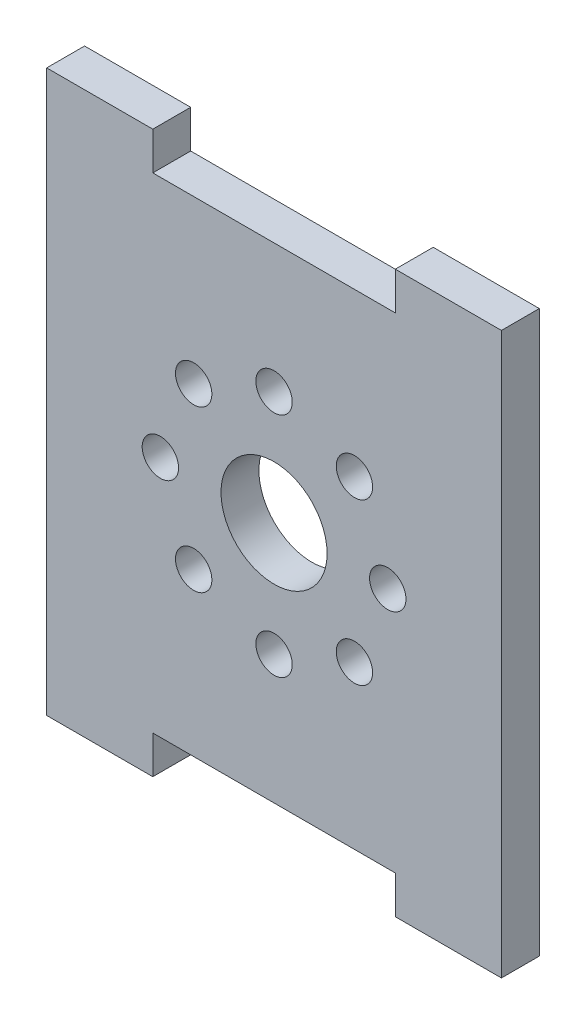
ISO-10303-21;
HEADER;
FILE_DESCRIPTION(('STEP AP214'),'2;1');
FILE_NAME('part.step','',(''),(''),'','','');
FILE_SCHEMA(('AUTOMOTIVE_DESIGN { 1 0 10303 214 1 1 1 1 }'));
ENDSEC;
DATA;
#1=APPLICATION_CONTEXT('core data for automotive mechanical design processes');
#2=APPLICATION_PROTOCOL_DEFINITION('international standard','automotive_design',2000,#1);
#3=PRODUCT_CONTEXT('',#1,'mechanical');
#4=PRODUCT('Part','Part','',(#3));
#5=PRODUCT_RELATED_PRODUCT_CATEGORY('part','',(#4));
#6=PRODUCT_DEFINITION_FORMATION('','',#4);
#7=PRODUCT_DEFINITION_CONTEXT('part definition',#1,'design');
#8=PRODUCT_DEFINITION('design','',#6,#7);
#9=PRODUCT_DEFINITION_SHAPE('','',#8);
#10=(LENGTH_UNIT() NAMED_UNIT(*) SI_UNIT(.MILLI.,.METRE.));
#11=(NAMED_UNIT(*) PLANE_ANGLE_UNIT() SI_UNIT($,.RADIAN.));
#12=(NAMED_UNIT(*) SI_UNIT($,.STERADIAN.) SOLID_ANGLE_UNIT());
#13=UNCERTAINTY_MEASURE_WITH_UNIT(LENGTH_MEASURE(1.E-05),#10,'distance_accuracy_value','');
#14=(GEOMETRIC_REPRESENTATION_CONTEXT(3) GLOBAL_UNCERTAINTY_ASSIGNED_CONTEXT((#13)) GLOBAL_UNIT_ASSIGNED_CONTEXT((#10,
#11,#12)) REPRESENTATION_CONTEXT('',''));
#15=CARTESIAN_POINT('',(0.,0.,0.));
#16=DIRECTION('',(0.,0.,1.));
#17=DIRECTION('',(1.,0.,0.));
#18=AXIS2_PLACEMENT_3D('',#15,#16,#17);
#19=CARTESIAN_POINT('',(0.,0.,1.25));
#20=DIRECTION('',(0.,0.,1.));
#21=DIRECTION('',(1.,0.,0.));
#22=AXIS2_PLACEMENT_3D('',#19,#20,#21);
#23=PLANE('',#22);
#24=CARTESIAN_POINT('',(-7.49999999999936,-6.3948846218409E-13,1.25));
#25=DIRECTION('',(0.,0.,1.));
#26=DIRECTION('',(1.,0.,0.));
#27=AXIS2_PLACEMENT_3D('',#24,#25,#26);
#28=CIRCLE('',#27,1.20000000000087);
#29=CARTESIAN_POINT('',(-6.29999999999849,-6.3948846218409E-13,1.25));
#30=VERTEX_POINT('',#29);
#31=EDGE_CURVE('E311',#30,#30,#28,.T.);
#32=ORIENTED_EDGE('',*,*,#31,.F.);
#33=EDGE_LOOP('',(#32));
#34=FACE_BOUND('',#33,.T.);
#35=CARTESIAN_POINT('',(1.27713995416946E-12,-7.5,1.25));
#36=DIRECTION('',(0.,0.,1.));
#37=DIRECTION('',(1.,0.,0.));
#38=AXIS2_PLACEMENT_3D('',#35,#36,#37);
#39=CIRCLE('',#38,1.20000000000127);
#40=CARTESIAN_POINT('',(1.20000000000255,-7.5,1.25));
#41=VERTEX_POINT('',#40);
#42=EDGE_CURVE('E323',#41,#41,#39,.T.);
#43=ORIENTED_EDGE('',*,*,#42,.F.);
#44=EDGE_LOOP('',(#43));
#45=FACE_BOUND('',#44,.T.);
#46=CARTESIAN_POINT('',(7.50000000000064,6.3856997708473E-13,1.25));
#47=DIRECTION('',(0.,0.,1.));
#48=DIRECTION('',(1.,0.,0.));
#49=AXIS2_PLACEMENT_3D('',#46,#47,#48);
#50=CIRCLE('',#49,1.20000000000045);
#51=CARTESIAN_POINT('',(8.70000000000109,6.3856997708473E-13,1.25));
#52=VERTEX_POINT('',#51);
#53=EDGE_CURVE('E335',#52,#52,#50,.T.);
#54=ORIENTED_EDGE('',*,*,#53,.F.);
#55=EDGE_LOOP('',(#54));
#56=FACE_BOUND('',#55,.T.);
#57=CARTESIAN_POINT('',(0.,7.5,1.25));
#58=DIRECTION('',(0.,0.,1.));
#59=DIRECTION('',(1.,0.,0.));
#60=AXIS2_PLACEMENT_3D('',#57,#58,#59);
#61=CIRCLE('',#60,1.2);
#62=CARTESIAN_POINT('',(1.2,7.5,1.25));
#63=VERTEX_POINT('',#62);
#64=EDGE_CURVE('E347',#63,#63,#61,.T.);
#65=ORIENTED_EDGE('',*,*,#64,.F.);
#66=EDGE_LOOP('',(#65));
#67=FACE_BOUND('',#66,.T.);
#68=DIRECTION('',(-1.,0.,0.));
#69=VECTOR('',#68,1.);
#70=CARTESIAN_POINT('',(8.,18.5,1.25));
#71=LINE('',#70,#69);
#72=CARTESIAN_POINT('',(15.,18.5,1.25));
#73=VERTEX_POINT('',#72);
#74=CARTESIAN_POINT('',(8.,18.5,1.25));
#75=VERTEX_POINT('',#74);
#76=EDGE_CURVE('E177',#73,#75,#71,.T.);
#77=ORIENTED_EDGE('',*,*,#76,.T.);
#78=DIRECTION('',(0.,-1.,0.));
#79=VECTOR('',#78,1.);
#80=CARTESIAN_POINT('',(8.,16.,1.25));
#81=LINE('',#80,#79);
#82=CARTESIAN_POINT('',(8.,16.,1.25));
#83=VERTEX_POINT('',#82);
#84=EDGE_CURVE('E105',#75,#83,#81,.T.);
#85=ORIENTED_EDGE('',*,*,#84,.T.);
#86=DIRECTION('',(-1.,0.,0.));
#87=VECTOR('',#86,1.);
#88=CARTESIAN_POINT('',(-8.,16.,1.25));
#89=LINE('',#88,#87);
#90=CARTESIAN_POINT('',(-8.,16.,1.25));
#91=VERTEX_POINT('',#90);
#92=EDGE_CURVE('E204',#83,#91,#89,.T.);
#93=ORIENTED_EDGE('',*,*,#92,.T.);
#94=DIRECTION('',(0.,1.,0.));
#95=VECTOR('',#94,1.);
#96=CARTESIAN_POINT('',(-8.,18.5,1.25));
#97=LINE('',#96,#95);
#98=CARTESIAN_POINT('',(-8.,18.5,1.25));
#99=VERTEX_POINT('',#98);
#100=EDGE_CURVE('E223',#91,#99,#97,.T.);
#101=ORIENTED_EDGE('',*,*,#100,.T.);
#102=DIRECTION('',(-1.,0.,0.));
#103=VECTOR('',#102,1.);
#104=CARTESIAN_POINT('',(-15.,18.5,1.25));
#105=LINE('',#104,#103);
#106=CARTESIAN_POINT('',(-15.,18.5,1.25));
#107=VERTEX_POINT('',#106);
#108=EDGE_CURVE('E220',#99,#107,#105,.T.);
#109=ORIENTED_EDGE('',*,*,#108,.T.);
#110=DIRECTION('',(0.,-1.,0.));
#111=VECTOR('',#110,1.);
#112=CARTESIAN_POINT('',(-15.,-18.5,1.25));
#113=LINE('',#112,#111);
#114=CARTESIAN_POINT('',(-15.,-18.5,1.25));
#115=VERTEX_POINT('',#114);
#116=EDGE_CURVE('E222',#107,#115,#113,.T.);
#117=ORIENTED_EDGE('',*,*,#116,.T.);
#118=DIRECTION('',(1.,0.,0.));
#119=VECTOR('',#118,1.);
#120=CARTESIAN_POINT('',(-15.,-18.5,1.25));
#121=LINE('',#120,#119);
#122=CARTESIAN_POINT('',(-8.,-18.5,1.25));
#123=VERTEX_POINT('',#122);
#124=EDGE_CURVE('E225',#115,#123,#121,.T.);
#125=ORIENTED_EDGE('',*,*,#124,.T.);
#126=DIRECTION('',(0.,1.,0.));
#127=VECTOR('',#126,1.);
#128=CARTESIAN_POINT('',(-8.,-18.5,1.25));
#129=LINE('',#128,#127);
#130=CARTESIAN_POINT('',(-8.,-16.,1.25));
#131=VERTEX_POINT('',#130);
#132=EDGE_CURVE('E231',#123,#131,#129,.T.);
#133=ORIENTED_EDGE('',*,*,#132,.T.);
#134=DIRECTION('',(1.,0.,0.));
#135=VECTOR('',#134,1.);
#136=CARTESIAN_POINT('',(-8.,-16.,1.25));
#137=LINE('',#136,#135);
#138=CARTESIAN_POINT('',(8.,-16.,1.25));
#139=VERTEX_POINT('',#138);
#140=EDGE_CURVE('E136',#131,#139,#137,.T.);
#141=ORIENTED_EDGE('',*,*,#140,.T.);
#142=DIRECTION('',(0.,-1.,0.));
#143=VECTOR('',#142,1.);
#144=CARTESIAN_POINT('',(8.,-16.,1.25));
#145=LINE('',#144,#143);
#146=CARTESIAN_POINT('',(8.,-18.5,1.25));
#147=VERTEX_POINT('',#146);
#148=EDGE_CURVE('E130',#139,#147,#145,.T.);
#149=ORIENTED_EDGE('',*,*,#148,.T.);
#150=DIRECTION('',(1.,0.,0.));
#151=VECTOR('',#150,1.);
#152=CARTESIAN_POINT('',(8.,-18.5,1.25));
#153=LINE('',#152,#151);
#154=CARTESIAN_POINT('',(15.,-18.5,1.25));
#155=VERTEX_POINT('',#154);
#156=EDGE_CURVE('E134',#147,#155,#153,.T.);
#157=ORIENTED_EDGE('',*,*,#156,.T.);
#158=DIRECTION('',(0.,1.,0.));
#159=VECTOR('',#158,1.);
#160=CARTESIAN_POINT('',(15.,-18.5,1.25));
#161=LINE('',#160,#159);
#162=EDGE_CURVE('E50',#155,#73,#161,.T.);
#163=ORIENTED_EDGE('',*,*,#162,.T.);
#164=EDGE_LOOP('',(#77,#85,#93,#101,#109,#117,#125,#133,#141,#149,#157,#163));
#165=FACE_BOUND('',#164,.T.);
#166=CARTESIAN_POINT('',(0.,0.,1.25));
#167=DIRECTION('',(0.,0.,1.));
#168=DIRECTION('',(1.,0.,0.));
#169=AXIS2_PLACEMENT_3D('',#166,#167,#168);
#170=CIRCLE('',#169,3.5);
#171=CARTESIAN_POINT('',(3.5,0.,1.25));
#172=VERTEX_POINT('',#171);
#173=EDGE_CURVE('E158',#172,#172,#170,.T.);
#174=ORIENTED_EDGE('',*,*,#173,.F.);
#175=EDGE_LOOP('',(#174));
#176=FACE_BOUND('',#175,.T.);
#177=CARTESIAN_POINT('',(5.30330085889929,5.30330085889956,1.25));
#178=DIRECTION('',(0.,0.,1.));
#179=DIRECTION('',(1.,0.,0.));
#180=AXIS2_PLACEMENT_3D('',#177,#178,#179);
#181=CIRCLE('',#180,1.20000000000006);
#182=CARTESIAN_POINT('',(6.50330085889935,5.30330085889956,1.25));
#183=VERTEX_POINT('',#182);
#184=EDGE_CURVE('E341',#183,#183,#181,.T.);
#185=ORIENTED_EDGE('',*,*,#184,.F.);
#186=EDGE_LOOP('',(#185));
#187=FACE_BOUND('',#186,.T.);
#188=CARTESIAN_POINT('',(5.3033008589002,-5.30330085889865,1.25));
#189=DIRECTION('',(0.,0.,1.));
#190=DIRECTION('',(1.,0.,0.));
#191=AXIS2_PLACEMENT_3D('',#188,#189,#190);
#192=CIRCLE('',#191,1.20000000000095);
#193=CARTESIAN_POINT('',(6.50330085890114,-5.30330085889865,1.25));
#194=VERTEX_POINT('',#193);
#195=EDGE_CURVE('E329',#194,#194,#192,.T.);
#196=ORIENTED_EDGE('',*,*,#195,.F.);
#197=EDGE_LOOP('',(#196));
#198=FACE_BOUND('',#197,.T.);
#199=CARTESIAN_POINT('',(-5.30330085889802,-5.30330085889956,1.25));
#200=DIRECTION('',(0.,0.,1.));
#201=DIRECTION('',(1.,0.,0.));
#202=AXIS2_PLACEMENT_3D('',#199,#200,#201);
#203=CIRCLE('',#202,1.20000000000124);
#204=CARTESIAN_POINT('',(-4.10330085889678,-5.30330085889956,1.25));
#205=VERTEX_POINT('',#204);
#206=EDGE_CURVE('E317',#205,#205,#203,.T.);
#207=ORIENTED_EDGE('',*,*,#206,.F.);
#208=EDGE_LOOP('',(#207));
#209=FACE_BOUND('',#208,.T.);
#210=CARTESIAN_POINT('',(-5.30330085889892,5.30330085889865,1.25));
#211=DIRECTION('',(0.,0.,1.));
#212=DIRECTION('',(1.,0.,0.));
#213=AXIS2_PLACEMENT_3D('',#210,#211,#212);
#214=CIRCLE('',#213,1.2000000000004);
#215=CARTESIAN_POINT('',(-4.10330085889852,5.30330085889865,1.25));
#216=VERTEX_POINT('',#215);
#217=EDGE_CURVE('E302',#216,#216,#214,.T.);
#218=ORIENTED_EDGE('',*,*,#217,.F.);
#219=EDGE_LOOP('',(#218));
#220=FACE_BOUND('',#219,.T.);
#221=ADVANCED_FACE('F33',(#34,#45,#56,#67,#165,#176,#187,#198,#209,#220),#23,.T.);
#222=CARTESIAN_POINT('',(0.,0.,-1.25));
#223=DIRECTION('',(0.,0.,1.));
#224=DIRECTION('',(1.,0.,0.));
#225=AXIS2_PLACEMENT_3D('',#222,#223,#224);
#226=PLANE('',#225);
#227=DIRECTION('',(-1.,0.,0.));
#228=VECTOR('',#227,1.);
#229=CARTESIAN_POINT('',(8.,18.5,-1.25));
#230=LINE('',#229,#228);
#231=CARTESIAN_POINT('',(15.,18.5,-1.25));
#232=VERTEX_POINT('',#231);
#233=CARTESIAN_POINT('',(8.,18.5,-1.25));
#234=VERTEX_POINT('',#233);
#235=EDGE_CURVE('E154',#232,#234,#230,.T.);
#236=ORIENTED_EDGE('',*,*,#235,.F.);
#237=DIRECTION('',(0.,1.,0.));
#238=VECTOR('',#237,1.);
#239=CARTESIAN_POINT('',(15.,-18.5,-1.25));
#240=LINE('',#239,#238);
#241=CARTESIAN_POINT('',(15.,-18.5,-1.25));
#242=VERTEX_POINT('',#241);
#243=EDGE_CURVE('E97',#242,#232,#240,.T.);
#244=ORIENTED_EDGE('',*,*,#243,.F.);
#245=DIRECTION('',(1.,0.,0.));
#246=VECTOR('',#245,1.);
#247=CARTESIAN_POINT('',(8.,-18.5,-1.25));
#248=LINE('',#247,#246);
#249=CARTESIAN_POINT('',(8.,-18.5,-1.25));
#250=VERTEX_POINT('',#249);
#251=EDGE_CURVE('E91',#250,#242,#248,.T.);
#252=ORIENTED_EDGE('',*,*,#251,.F.);
#253=DIRECTION('',(0.,-1.,0.));
#254=VECTOR('',#253,1.);
#255=CARTESIAN_POINT('',(8.,-16.,-1.25));
#256=LINE('',#255,#254);
#257=CARTESIAN_POINT('',(8.,-16.,-1.25));
#258=VERTEX_POINT('',#257);
#259=EDGE_CURVE('E144',#258,#250,#256,.T.);
#260=ORIENTED_EDGE('',*,*,#259,.F.);
#261=DIRECTION('',(1.,0.,0.));
#262=VECTOR('',#261,1.);
#263=CARTESIAN_POINT('',(-8.,-16.,-1.25));
#264=LINE('',#263,#262);
#265=CARTESIAN_POINT('',(-8.,-16.,-1.25));
#266=VERTEX_POINT('',#265);
#267=EDGE_CURVE('E172',#266,#258,#264,.T.);
#268=ORIENTED_EDGE('',*,*,#267,.F.);
#269=DIRECTION('',(0.,1.,0.));
#270=VECTOR('',#269,1.);
#271=CARTESIAN_POINT('',(-8.,-18.5,-1.25));
#272=LINE('',#271,#270);
#273=CARTESIAN_POINT('',(-8.,-18.5,-1.25));
#274=VERTEX_POINT('',#273);
#275=EDGE_CURVE('E170',#274,#266,#272,.T.);
#276=ORIENTED_EDGE('',*,*,#275,.F.);
#277=DIRECTION('',(1.,0.,0.));
#278=VECTOR('',#277,1.);
#279=CARTESIAN_POINT('',(-15.,-18.5,-1.25));
#280=LINE('',#279,#278);
#281=CARTESIAN_POINT('',(-15.,-18.5,-1.25));
#282=VERTEX_POINT('',#281);
#283=EDGE_CURVE('E168',#282,#274,#280,.T.);
#284=ORIENTED_EDGE('',*,*,#283,.F.);
#285=DIRECTION('',(0.,-1.,0.));
#286=VECTOR('',#285,1.);
#287=CARTESIAN_POINT('',(-15.,-18.5,-1.25));
#288=LINE('',#287,#286);
#289=CARTESIAN_POINT('',(-15.,18.5,-1.25));
#290=VERTEX_POINT('',#289);
#291=EDGE_CURVE('E166',#290,#282,#288,.T.);
#292=ORIENTED_EDGE('',*,*,#291,.F.);
#293=DIRECTION('',(-1.,0.,0.));
#294=VECTOR('',#293,1.);
#295=CARTESIAN_POINT('',(-15.,18.5,-1.25));
#296=LINE('',#295,#294);
#297=CARTESIAN_POINT('',(-8.,18.5,-1.25));
#298=VERTEX_POINT('',#297);
#299=EDGE_CURVE('E164',#298,#290,#296,.T.);
#300=ORIENTED_EDGE('',*,*,#299,.F.);
#301=DIRECTION('',(0.,1.,0.));
#302=VECTOR('',#301,1.);
#303=CARTESIAN_POINT('',(-8.,18.5,-1.25));
#304=LINE('',#303,#302);
#305=CARTESIAN_POINT('',(-8.,16.,-1.25));
#306=VERTEX_POINT('',#305);
#307=EDGE_CURVE('E162',#306,#298,#304,.T.);
#308=ORIENTED_EDGE('',*,*,#307,.F.);
#309=DIRECTION('',(-1.,0.,0.));
#310=VECTOR('',#309,1.);
#311=CARTESIAN_POINT('',(-8.,16.,-1.25));
#312=LINE('',#311,#310);
#313=CARTESIAN_POINT('',(8.,16.,-1.25));
#314=VERTEX_POINT('',#313);
#315=EDGE_CURVE('E160',#314,#306,#312,.T.);
#316=ORIENTED_EDGE('',*,*,#315,.F.);
#317=DIRECTION('',(0.,-1.,0.));
#318=VECTOR('',#317,1.);
#319=CARTESIAN_POINT('',(8.,16.,-1.25));
#320=LINE('',#319,#318);
#321=EDGE_CURVE('E157',#234,#314,#320,.T.);
#322=ORIENTED_EDGE('',*,*,#321,.F.);
#323=EDGE_LOOP('',(#236,#244,#252,#260,#268,#276,#284,#292,#300,#308,#316,#322));
#324=FACE_BOUND('',#323,.T.);
#325=CARTESIAN_POINT('',(0.,0.,-1.25));
#326=DIRECTION('',(0.,0.,1.));
#327=DIRECTION('',(1.,0.,0.));
#328=AXIS2_PLACEMENT_3D('',#325,#326,#327);
#329=CIRCLE('',#328,3.5);
#330=CARTESIAN_POINT('',(3.5,0.,-1.25));
#331=VERTEX_POINT('',#330);
#332=EDGE_CURVE('E350',#331,#331,#329,.T.);
#333=ORIENTED_EDGE('',*,*,#332,.T.);
#334=EDGE_LOOP('',(#333));
#335=FACE_BOUND('',#334,.T.);
#336=CARTESIAN_POINT('',(0.,7.5,-1.25));
#337=DIRECTION('',(0.,0.,1.));
#338=DIRECTION('',(1.,0.,0.));
#339=AXIS2_PLACEMENT_3D('',#336,#337,#338);
#340=CIRCLE('',#339,1.2);
#341=CARTESIAN_POINT('',(1.2,7.5,-1.25));
#342=VERTEX_POINT('',#341);
#343=EDGE_CURVE('E344',#342,#342,#340,.T.);
#344=ORIENTED_EDGE('',*,*,#343,.T.);
#345=EDGE_LOOP('',(#344));
#346=FACE_BOUND('',#345,.T.);
#347=CARTESIAN_POINT('',(5.30330085889929,5.30330085889956,-1.25));
#348=DIRECTION('',(0.,0.,1.));
#349=DIRECTION('',(1.,0.,0.));
#350=AXIS2_PLACEMENT_3D('',#347,#348,#349);
#351=CIRCLE('',#350,1.20000000000006);
#352=CARTESIAN_POINT('',(6.50330085889935,5.30330085889956,-1.25));
#353=VERTEX_POINT('',#352);
#354=EDGE_CURVE('E338',#353,#353,#351,.T.);
#355=ORIENTED_EDGE('',*,*,#354,.T.);
#356=EDGE_LOOP('',(#355));
#357=FACE_BOUND('',#356,.T.);
#358=CARTESIAN_POINT('',(7.50000000000064,6.3856997708473E-13,-1.25));
#359=DIRECTION('',(0.,0.,1.));
#360=DIRECTION('',(1.,0.,0.));
#361=AXIS2_PLACEMENT_3D('',#358,#359,#360);
#362=CIRCLE('',#361,1.20000000000045);
#363=CARTESIAN_POINT('',(8.70000000000109,6.3856997708473E-13,-1.25));
#364=VERTEX_POINT('',#363);
#365=EDGE_CURVE('E332',#364,#364,#362,.T.);
#366=ORIENTED_EDGE('',*,*,#365,.T.);
#367=EDGE_LOOP('',(#366));
#368=FACE_BOUND('',#367,.T.);
#369=CARTESIAN_POINT('',(5.3033008589002,-5.30330085889865,-1.25));
#370=DIRECTION('',(0.,0.,1.));
#371=DIRECTION('',(1.,0.,0.));
#372=AXIS2_PLACEMENT_3D('',#369,#370,#371);
#373=CIRCLE('',#372,1.20000000000095);
#374=CARTESIAN_POINT('',(6.50330085890114,-5.30330085889865,-1.25));
#375=VERTEX_POINT('',#374);
#376=EDGE_CURVE('E326',#375,#375,#373,.T.);
#377=ORIENTED_EDGE('',*,*,#376,.T.);
#378=EDGE_LOOP('',(#377));
#379=FACE_BOUND('',#378,.T.);
#380=CARTESIAN_POINT('',(1.27713995416946E-12,-7.5,-1.25));
#381=DIRECTION('',(0.,0.,1.));
#382=DIRECTION('',(1.,0.,0.));
#383=AXIS2_PLACEMENT_3D('',#380,#381,#382);
#384=CIRCLE('',#383,1.20000000000127);
#385=CARTESIAN_POINT('',(1.20000000000255,-7.5,-1.25));
#386=VERTEX_POINT('',#385);
#387=EDGE_CURVE('E320',#386,#386,#384,.T.);
#388=ORIENTED_EDGE('',*,*,#387,.T.);
#389=EDGE_LOOP('',(#388));
#390=FACE_BOUND('',#389,.T.);
#391=CARTESIAN_POINT('',(-5.30330085889802,-5.30330085889956,-1.25));
#392=DIRECTION('',(0.,0.,1.));
#393=DIRECTION('',(1.,0.,0.));
#394=AXIS2_PLACEMENT_3D('',#391,#392,#393);
#395=CIRCLE('',#394,1.20000000000124);
#396=CARTESIAN_POINT('',(-4.10330085889678,-5.30330085889956,-1.25));
#397=VERTEX_POINT('',#396);
#398=EDGE_CURVE('E314',#397,#397,#395,.T.);
#399=ORIENTED_EDGE('',*,*,#398,.T.);
#400=EDGE_LOOP('',(#399));
#401=FACE_BOUND('',#400,.T.);
#402=CARTESIAN_POINT('',(-7.49999999999936,-6.3948846218409E-13,-1.25));
#403=DIRECTION('',(0.,0.,1.));
#404=DIRECTION('',(1.,0.,0.));
#405=AXIS2_PLACEMENT_3D('',#402,#403,#404);
#406=CIRCLE('',#405,1.20000000000087);
#407=CARTESIAN_POINT('',(-6.29999999999849,-6.3948846218409E-13,-1.25));
#408=VERTEX_POINT('',#407);
#409=EDGE_CURVE('E308',#408,#408,#406,.T.);
#410=ORIENTED_EDGE('',*,*,#409,.T.);
#411=EDGE_LOOP('',(#410));
#412=FACE_BOUND('',#411,.T.);
#413=CARTESIAN_POINT('',(-5.30330085889892,5.30330085889865,-1.25));
#414=DIRECTION('',(0.,0.,1.));
#415=DIRECTION('',(1.,0.,0.));
#416=AXIS2_PLACEMENT_3D('',#413,#414,#415);
#417=CIRCLE('',#416,1.2000000000004);
#418=CARTESIAN_POINT('',(-4.10330085889852,5.30330085889865,-1.25));
#419=VERTEX_POINT('',#418);
#420=EDGE_CURVE('E305',#419,#419,#417,.T.);
#421=ORIENTED_EDGE('',*,*,#420,.T.);
#422=EDGE_LOOP('',(#421));
#423=FACE_BOUND('',#422,.T.);
#424=ADVANCED_FACE('F208',(#324,#335,#346,#357,#368,#379,#390,#401,#412,#423),#226,.F.);
#425=CARTESIAN_POINT('',(8.,18.5,1.25));
#426=DIRECTION('',(0.,-1.,0.));
#427=DIRECTION('',(0.,0.,-1.));
#428=AXIS2_PLACEMENT_3D('',#425,#426,#427);
#429=PLANE('',#428);
#430=ORIENTED_EDGE('',*,*,#235,.T.);
#431=DIRECTION('',(0.,0.,-1.));
#432=VECTOR('',#431,1.);
#433=CARTESIAN_POINT('',(8.,18.5,1.25));
#434=LINE('',#433,#432);
#435=EDGE_CURVE('E11',#75,#234,#434,.T.);
#436=ORIENTED_EDGE('',*,*,#435,.F.);
#437=ORIENTED_EDGE('',*,*,#76,.F.);
#438=DIRECTION('',(0.,0.,-1.));
#439=VECTOR('',#438,1.);
#440=CARTESIAN_POINT('',(15.,18.5,1.25));
#441=LINE('',#440,#439);
#442=EDGE_CURVE('E150',#73,#232,#441,.T.);
#443=ORIENTED_EDGE('',*,*,#442,.T.);
#444=EDGE_LOOP('',(#430,#436,#437,#443));
#445=FACE_BOUND('',#444,.T.);
#446=ADVANCED_FACE('F35',(#445),#429,.F.);
#447=CARTESIAN_POINT('',(8.,16.,1.25));
#448=DIRECTION('',(1.,0.,0.));
#449=DIRECTION('',(0.,0.,-1.));
#450=AXIS2_PLACEMENT_3D('',#447,#448,#449);
#451=PLANE('',#450);
#452=ORIENTED_EDGE('',*,*,#321,.T.);
#453=DIRECTION('',(0.,0.,-1.));
#454=VECTOR('',#453,1.);
#455=CARTESIAN_POINT('',(8.,16.,1.25));
#456=LINE('',#455,#454);
#457=EDGE_CURVE('E42',#83,#314,#456,.T.);
#458=ORIENTED_EDGE('',*,*,#457,.F.);
#459=ORIENTED_EDGE('',*,*,#84,.F.);
#460=ORIENTED_EDGE('',*,*,#435,.T.);
#461=EDGE_LOOP('',(#452,#458,#459,#460));
#462=FACE_BOUND('',#461,.T.);
#463=ADVANCED_FACE('F505',(#462),#451,.F.);
#464=CARTESIAN_POINT('',(-8.,16.,1.25));
#465=DIRECTION('',(0.,-1.,0.));
#466=DIRECTION('',(0.,0.,-1.));
#467=AXIS2_PLACEMENT_3D('',#464,#465,#466);
#468=PLANE('',#467);
#469=ORIENTED_EDGE('',*,*,#315,.T.);
#470=DIRECTION('',(0.,0.,-1.));
#471=VECTOR('',#470,1.);
#472=CARTESIAN_POINT('',(-8.,16.,1.25));
#473=LINE('',#472,#471);
#474=EDGE_CURVE('E196',#91,#306,#473,.T.);
#475=ORIENTED_EDGE('',*,*,#474,.F.);
#476=ORIENTED_EDGE('',*,*,#92,.F.);
#477=ORIENTED_EDGE('',*,*,#457,.T.);
#478=EDGE_LOOP('',(#469,#475,#476,#477));
#479=FACE_BOUND('',#478,.T.);
#480=ADVANCED_FACE('F202',(#479),#468,.F.);
#481=CARTESIAN_POINT('',(-8.,18.5,1.25));
#482=DIRECTION('',(-1.,0.,0.));
#483=DIRECTION('',(0.,0.,1.));
#484=AXIS2_PLACEMENT_3D('',#481,#482,#483);
#485=PLANE('',#484);
#486=ORIENTED_EDGE('',*,*,#307,.T.);
#487=DIRECTION('',(0.,0.,-1.));
#488=VECTOR('',#487,1.);
#489=CARTESIAN_POINT('',(-8.,18.5,1.25));
#490=LINE('',#489,#488);
#491=EDGE_CURVE('E193',#99,#298,#490,.T.);
#492=ORIENTED_EDGE('',*,*,#491,.F.);
#493=ORIENTED_EDGE('',*,*,#100,.F.);
#494=ORIENTED_EDGE('',*,*,#474,.T.);
#495=EDGE_LOOP('',(#486,#492,#493,#494));
#496=FACE_BOUND('',#495,.T.);
#497=ADVANCED_FACE('F214',(#496),#485,.F.);
#498=CARTESIAN_POINT('',(-15.,18.5,1.25));
#499=DIRECTION('',(0.,-1.,0.));
#500=DIRECTION('',(0.,0.,-1.));
#501=AXIS2_PLACEMENT_3D('',#498,#499,#500);
#502=PLANE('',#501);
#503=ORIENTED_EDGE('',*,*,#299,.T.);
#504=DIRECTION('',(0.,0.,-1.));
#505=VECTOR('',#504,1.);
#506=CARTESIAN_POINT('',(-15.,18.5,1.25));
#507=LINE('',#506,#505);
#508=EDGE_CURVE('E190',#107,#290,#507,.T.);
#509=ORIENTED_EDGE('',*,*,#508,.F.);
#510=ORIENTED_EDGE('',*,*,#108,.F.);
#511=ORIENTED_EDGE('',*,*,#491,.T.);
#512=EDGE_LOOP('',(#503,#509,#510,#511));
#513=FACE_BOUND('',#512,.T.);
#514=ADVANCED_FACE('F218',(#513),#502,.F.);
#515=CARTESIAN_POINT('',(-15.,-18.5,1.25));
#516=DIRECTION('',(1.,0.,0.));
#517=DIRECTION('',(0.,0.,-1.));
#518=AXIS2_PLACEMENT_3D('',#515,#516,#517);
#519=PLANE('',#518);
#520=ORIENTED_EDGE('',*,*,#291,.T.);
#521=DIRECTION('',(0.,0.,-1.));
#522=VECTOR('',#521,1.);
#523=CARTESIAN_POINT('',(-15.,-18.5,1.25));
#524=LINE('',#523,#522);
#525=EDGE_CURVE('E187',#115,#282,#524,.T.);
#526=ORIENTED_EDGE('',*,*,#525,.F.);
#527=ORIENTED_EDGE('',*,*,#116,.F.);
#528=ORIENTED_EDGE('',*,*,#508,.T.);
#529=EDGE_LOOP('',(#520,#526,#527,#528));
#530=FACE_BOUND('',#529,.T.);
#531=ADVANCED_FACE('F470',(#530),#519,.F.);
#532=CARTESIAN_POINT('',(-15.,-18.5,1.25));
#533=DIRECTION('',(0.,1.,0.));
#534=DIRECTION('',(0.,0.,1.));
#535=AXIS2_PLACEMENT_3D('',#532,#533,#534);
#536=PLANE('',#535);
#537=ORIENTED_EDGE('',*,*,#283,.T.);
#538=DIRECTION('',(0.,0.,-1.));
#539=VECTOR('',#538,1.);
#540=CARTESIAN_POINT('',(-8.,-18.5,1.25));
#541=LINE('',#540,#539);
#542=EDGE_CURVE('E184',#123,#274,#541,.T.);
#543=ORIENTED_EDGE('',*,*,#542,.F.);
#544=ORIENTED_EDGE('',*,*,#124,.F.);
#545=ORIENTED_EDGE('',*,*,#525,.T.);
#546=EDGE_LOOP('',(#537,#543,#544,#545));
#547=FACE_BOUND('',#546,.T.);
#548=ADVANCED_FACE('F461',(#547),#536,.F.);
#549=CARTESIAN_POINT('',(-8.,-18.5,1.25));
#550=DIRECTION('',(-1.,0.,0.));
#551=DIRECTION('',(0.,0.,1.));
#552=AXIS2_PLACEMENT_3D('',#549,#550,#551);
#553=PLANE('',#552);
#554=ORIENTED_EDGE('',*,*,#275,.T.);
#555=DIRECTION('',(0.,0.,-1.));
#556=VECTOR('',#555,1.);
#557=CARTESIAN_POINT('',(-8.,-16.,1.25));
#558=LINE('',#557,#556);
#559=EDGE_CURVE('E181',#131,#266,#558,.T.);
#560=ORIENTED_EDGE('',*,*,#559,.F.);
#561=ORIENTED_EDGE('',*,*,#132,.F.);
#562=ORIENTED_EDGE('',*,*,#542,.T.);
#563=EDGE_LOOP('',(#554,#560,#561,#562));
#564=FACE_BOUND('',#563,.T.);
#565=ADVANCED_FACE('F237',(#564),#553,.F.);
#566=CARTESIAN_POINT('',(-8.,-16.,1.25));
#567=DIRECTION('',(0.,1.,0.));
#568=DIRECTION('',(0.,0.,1.));
#569=AXIS2_PLACEMENT_3D('',#566,#567,#568);
#570=PLANE('',#569);
#571=ORIENTED_EDGE('',*,*,#267,.T.);
#572=DIRECTION('',(0.,0.,-1.));
#573=VECTOR('',#572,1.);
#574=CARTESIAN_POINT('',(8.,-16.,1.25));
#575=LINE('',#574,#573);
#576=EDGE_CURVE('E145',#139,#258,#575,.T.);
#577=ORIENTED_EDGE('',*,*,#576,.F.);
#578=ORIENTED_EDGE('',*,*,#140,.F.);
#579=ORIENTED_EDGE('',*,*,#559,.T.);
#580=EDGE_LOOP('',(#571,#577,#578,#579));
#581=FACE_BOUND('',#580,.T.);
#582=ADVANCED_FACE('F241',(#581),#570,.F.);
#583=CARTESIAN_POINT('',(8.,-16.,1.25));
#584=DIRECTION('',(1.,0.,0.));
#585=DIRECTION('',(0.,0.,-1.));
#586=AXIS2_PLACEMENT_3D('',#583,#584,#585);
#587=PLANE('',#586);
#588=ORIENTED_EDGE('',*,*,#259,.T.);
#589=DIRECTION('',(0.,0.,-1.));
#590=VECTOR('',#589,1.);
#591=CARTESIAN_POINT('',(8.,-18.5,1.25));
#592=LINE('',#591,#590);
#593=EDGE_CURVE('E141',#147,#250,#592,.T.);
#594=ORIENTED_EDGE('',*,*,#593,.F.);
#595=ORIENTED_EDGE('',*,*,#148,.F.);
#596=ORIENTED_EDGE('',*,*,#576,.T.);
#597=EDGE_LOOP('',(#588,#594,#595,#596));
#598=FACE_BOUND('',#597,.T.);
#599=ADVANCED_FACE('F142',(#598),#587,.F.);
#600=CARTESIAN_POINT('',(8.,-18.5,1.25));
#601=DIRECTION('',(0.,1.,0.));
#602=DIRECTION('',(0.,0.,1.));
#603=AXIS2_PLACEMENT_3D('',#600,#601,#602);
#604=PLANE('',#603);
#605=ORIENTED_EDGE('',*,*,#251,.T.);
#606=DIRECTION('',(0.,0.,-1.));
#607=VECTOR('',#606,1.);
#608=CARTESIAN_POINT('',(15.,-18.5,1.25));
#609=LINE('',#608,#607);
#610=EDGE_CURVE('E146',#155,#242,#609,.T.);
#611=ORIENTED_EDGE('',*,*,#610,.F.);
#612=ORIENTED_EDGE('',*,*,#156,.F.);
#613=ORIENTED_EDGE('',*,*,#593,.T.);
#614=EDGE_LOOP('',(#605,#611,#612,#613));
#615=FACE_BOUND('',#614,.T.);
#616=ADVANCED_FACE('F148',(#615),#604,.F.);
#617=CARTESIAN_POINT('',(15.,-18.5,1.25));
#618=DIRECTION('',(-1.,0.,0.));
#619=DIRECTION('',(0.,0.,1.));
#620=AXIS2_PLACEMENT_3D('',#617,#618,#619);
#621=PLANE('',#620);
#622=ORIENTED_EDGE('',*,*,#243,.T.);
#623=ORIENTED_EDGE('',*,*,#442,.F.);
#624=ORIENTED_EDGE('',*,*,#162,.F.);
#625=ORIENTED_EDGE('',*,*,#610,.T.);
#626=EDGE_LOOP('',(#622,#623,#624,#625));
#627=FACE_BOUND('',#626,.T.);
#628=ADVANCED_FACE('F245',(#627),#621,.F.);
#629=CARTESIAN_POINT('',(0.,0.,1.25));
#630=DIRECTION('',(0.,0.,-1.));
#631=DIRECTION('',(-1.,0.,0.));
#632=AXIS2_PLACEMENT_3D('',#629,#630,#631);
#633=CYLINDRICAL_SURFACE('',#632,3.5);
#634=ORIENTED_EDGE('',*,*,#173,.T.);
#635=EDGE_LOOP('',(#634));
#636=FACE_BOUND('',#635,.T.);
#637=ORIENTED_EDGE('',*,*,#332,.F.);
#638=EDGE_LOOP('',(#637));
#639=FACE_BOUND('',#638,.T.);
#640=ADVANCED_FACE('F247',(#636,#639),#633,.F.);
#641=CARTESIAN_POINT('',(0.,7.5,1.25));
#642=DIRECTION('',(0.,0.,-1.));
#643=DIRECTION('',(-1.,0.,0.));
#644=AXIS2_PLACEMENT_3D('',#641,#642,#643);
#645=CYLINDRICAL_SURFACE('',#644,1.2);
#646=ORIENTED_EDGE('',*,*,#64,.T.);
#647=EDGE_LOOP('',(#646));
#648=FACE_BOUND('',#647,.T.);
#649=ORIENTED_EDGE('',*,*,#343,.F.);
#650=EDGE_LOOP('',(#649));
#651=FACE_BOUND('',#650,.T.);
#652=ADVANCED_FACE('F253',(#648,#651),#645,.F.);
#653=CARTESIAN_POINT('',(5.30330085889929,5.30330085889956,1.25));
#654=DIRECTION('',(0.,0.,-1.));
#655=DIRECTION('',(-1.,0.,0.));
#656=AXIS2_PLACEMENT_3D('',#653,#654,#655);
#657=CYLINDRICAL_SURFACE('',#656,1.20000000000006);
#658=ORIENTED_EDGE('',*,*,#184,.T.);
#659=EDGE_LOOP('',(#658));
#660=FACE_BOUND('',#659,.T.);
#661=ORIENTED_EDGE('',*,*,#354,.F.);
#662=EDGE_LOOP('',(#661));
#663=FACE_BOUND('',#662,.T.);
#664=ADVANCED_FACE('F269',(#660,#663),#657,.F.);
#665=CARTESIAN_POINT('',(7.50000000000064,6.3856997708473E-13,1.25));
#666=DIRECTION('',(0.,0.,-1.));
#667=DIRECTION('',(-1.,0.,0.));
#668=AXIS2_PLACEMENT_3D('',#665,#666,#667);
#669=CYLINDRICAL_SURFACE('',#668,1.20000000000045);
#670=ORIENTED_EDGE('',*,*,#53,.T.);
#671=EDGE_LOOP('',(#670));
#672=FACE_BOUND('',#671,.T.);
#673=ORIENTED_EDGE('',*,*,#365,.F.);
#674=EDGE_LOOP('',(#673));
#675=FACE_BOUND('',#674,.T.);
#676=ADVANCED_FACE('F273',(#672,#675),#669,.F.);
#677=CARTESIAN_POINT('',(5.3033008589002,-5.30330085889865,1.25));
#678=DIRECTION('',(0.,0.,-1.));
#679=DIRECTION('',(-1.,0.,0.));
#680=AXIS2_PLACEMENT_3D('',#677,#678,#679);
#681=CYLINDRICAL_SURFACE('',#680,1.20000000000095);
#682=ORIENTED_EDGE('',*,*,#195,.T.);
#683=EDGE_LOOP('',(#682));
#684=FACE_BOUND('',#683,.T.);
#685=ORIENTED_EDGE('',*,*,#376,.F.);
#686=EDGE_LOOP('',(#685));
#687=FACE_BOUND('',#686,.T.);
#688=ADVANCED_FACE('F277',(#684,#687),#681,.F.);
#689=CARTESIAN_POINT('',(1.27713995416946E-12,-7.5,1.25));
#690=DIRECTION('',(0.,0.,-1.));
#691=DIRECTION('',(-1.,0.,0.));
#692=AXIS2_PLACEMENT_3D('',#689,#690,#691);
#693=CYLINDRICAL_SURFACE('',#692,1.20000000000127);
#694=ORIENTED_EDGE('',*,*,#42,.T.);
#695=EDGE_LOOP('',(#694));
#696=FACE_BOUND('',#695,.T.);
#697=ORIENTED_EDGE('',*,*,#387,.F.);
#698=EDGE_LOOP('',(#697));
#699=FACE_BOUND('',#698,.T.);
#700=ADVANCED_FACE('F281',(#696,#699),#693,.F.);
#701=CARTESIAN_POINT('',(-5.30330085889802,-5.30330085889956,1.25));
#702=DIRECTION('',(0.,0.,-1.));
#703=DIRECTION('',(-1.,0.,0.));
#704=AXIS2_PLACEMENT_3D('',#701,#702,#703);
#705=CYLINDRICAL_SURFACE('',#704,1.20000000000124);
#706=ORIENTED_EDGE('',*,*,#206,.T.);
#707=EDGE_LOOP('',(#706));
#708=FACE_BOUND('',#707,.T.);
#709=ORIENTED_EDGE('',*,*,#398,.F.);
#710=EDGE_LOOP('',(#709));
#711=FACE_BOUND('',#710,.T.);
#712=ADVANCED_FACE('F285',(#708,#711),#705,.F.);
#713=CARTESIAN_POINT('',(-7.49999999999936,-6.3948846218409E-13,1.25));
#714=DIRECTION('',(0.,0.,-1.));
#715=DIRECTION('',(-1.,0.,0.));
#716=AXIS2_PLACEMENT_3D('',#713,#714,#715);
#717=CYLINDRICAL_SURFACE('',#716,1.20000000000087);
#718=ORIENTED_EDGE('',*,*,#31,.T.);
#719=EDGE_LOOP('',(#718));
#720=FACE_BOUND('',#719,.T.);
#721=ORIENTED_EDGE('',*,*,#409,.F.);
#722=EDGE_LOOP('',(#721));
#723=FACE_BOUND('',#722,.T.);
#724=ADVANCED_FACE('F289',(#720,#723),#717,.F.);
#725=CARTESIAN_POINT('',(-5.30330085889892,5.30330085889865,1.25));
#726=DIRECTION('',(0.,0.,-1.));
#727=DIRECTION('',(-1.,0.,0.));
#728=AXIS2_PLACEMENT_3D('',#725,#726,#727);
#729=CYLINDRICAL_SURFACE('',#728,1.2000000000004);
#730=ORIENTED_EDGE('',*,*,#217,.T.);
#731=EDGE_LOOP('',(#730));
#732=FACE_BOUND('',#731,.T.);
#733=ORIENTED_EDGE('',*,*,#420,.F.);
#734=EDGE_LOOP('',(#733));
#735=FACE_BOUND('',#734,.T.);
#736=ADVANCED_FACE('F293',(#732,#735),#729,.F.);
#737=CLOSED_SHELL('',(#221,#424,#446,#463,#480,#497,#514,#531,#548,#565,#582,#599,#616,#628,
#640,#652,#664,#676,#688,#700,#712,#724,#736));
#738=MANIFOLD_SOLID_BREP('B2',#737);
#739=ADVANCED_BREP_SHAPE_REPRESENTATION('',(#18,#738),#14);
#740=SHAPE_DEFINITION_REPRESENTATION(#9,#739);
ENDSEC;
END-ISO-10303-21;
